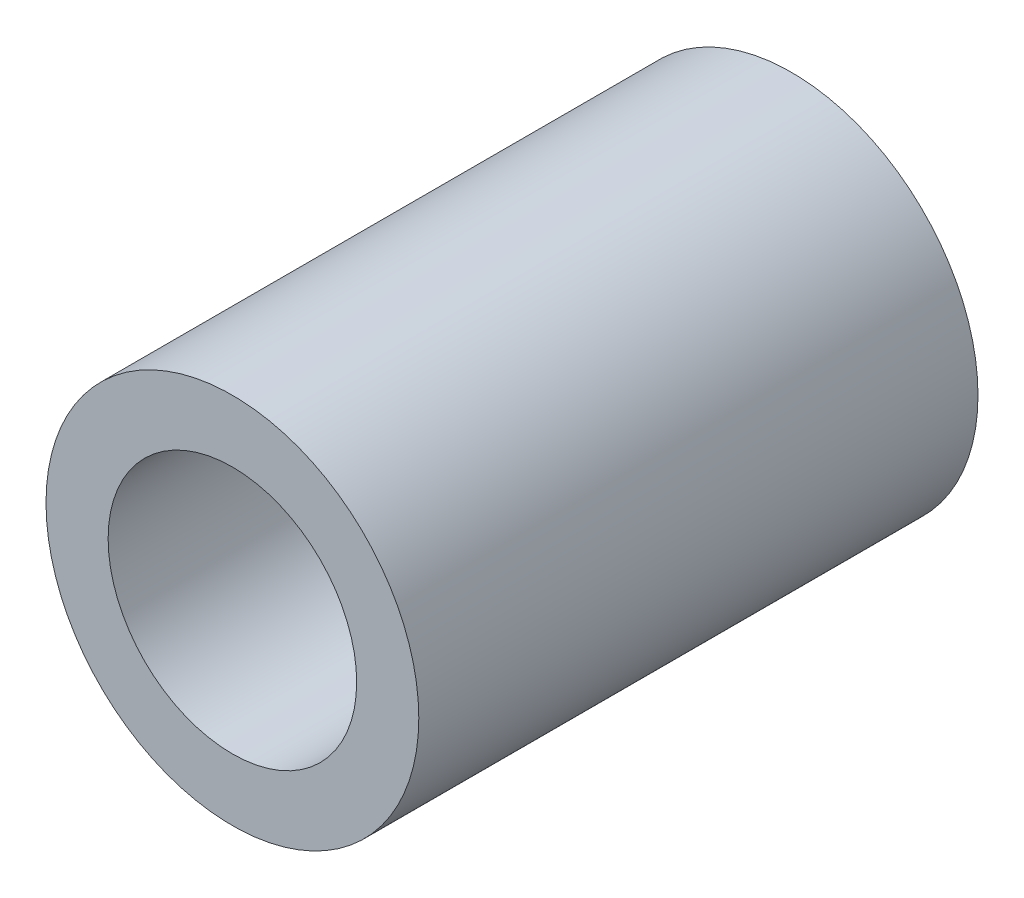
ISO-10303-21;
HEADER;
FILE_DESCRIPTION(('STEP AP214'),'2;1');
FILE_NAME('part.step','',(''),(''),'','','');
FILE_SCHEMA(('AUTOMOTIVE_DESIGN { 1 0 10303 214 1 1 1 1 }'));
ENDSEC;
DATA;
#1=APPLICATION_CONTEXT('core data for automotive mechanical design processes');
#2=APPLICATION_PROTOCOL_DEFINITION('international standard','automotive_design',2000,#1);
#3=PRODUCT_CONTEXT('',#1,'mechanical');
#4=PRODUCT('Part','Part','',(#3));
#5=PRODUCT_RELATED_PRODUCT_CATEGORY('part','',(#4));
#6=PRODUCT_DEFINITION_FORMATION('','',#4);
#7=PRODUCT_DEFINITION_CONTEXT('part definition',#1,'design');
#8=PRODUCT_DEFINITION('design','',#6,#7);
#9=PRODUCT_DEFINITION_SHAPE('','',#8);
#10=(LENGTH_UNIT() NAMED_UNIT(*) SI_UNIT(.MILLI.,.METRE.));
#11=(NAMED_UNIT(*) PLANE_ANGLE_UNIT() SI_UNIT($,.RADIAN.));
#12=(NAMED_UNIT(*) SI_UNIT($,.STERADIAN.) SOLID_ANGLE_UNIT());
#13=UNCERTAINTY_MEASURE_WITH_UNIT(LENGTH_MEASURE(1.E-05),#10,'distance_accuracy_value','');
#14=(GEOMETRIC_REPRESENTATION_CONTEXT(3) GLOBAL_UNCERTAINTY_ASSIGNED_CONTEXT((#13)) GLOBAL_UNIT_ASSIGNED_CONTEXT((#10,
#11,#12)) REPRESENTATION_CONTEXT('',''));
#15=CARTESIAN_POINT('',(0.,0.,0.));
#16=DIRECTION('',(0.,0.,1.));
#17=DIRECTION('',(1.,0.,0.));
#18=AXIS2_PLACEMENT_3D('',#15,#16,#17);
#19=CARTESIAN_POINT('',(0.,0.,9.));
#20=DIRECTION('',(0.,0.,1.));
#21=DIRECTION('',(1.,0.,0.));
#22=AXIS2_PLACEMENT_3D('',#19,#20,#21);
#23=PLANE('',#22);
#24=CARTESIAN_POINT('',(0.,0.,9.));
#25=DIRECTION('',(0.,0.,1.));
#26=DIRECTION('',(1.,0.,0.));
#27=AXIS2_PLACEMENT_3D('',#24,#25,#26);
#28=CIRCLE('',#27,3.);
#29=CARTESIAN_POINT('',(3.,0.,9.));
#30=VERTEX_POINT('',#29);
#31=EDGE_CURVE('E10',#30,#30,#28,.T.);
#32=ORIENTED_EDGE('',*,*,#31,.T.);
#33=EDGE_LOOP('',(#32));
#34=FACE_BOUND('',#33,.T.);
#35=CARTESIAN_POINT('',(0.,0.,9.));
#36=DIRECTION('',(0.,0.,1.));
#37=DIRECTION('',(1.,0.,0.));
#38=AXIS2_PLACEMENT_3D('',#35,#36,#37);
#39=CIRCLE('',#38,2.);
#40=CARTESIAN_POINT('',(2.,0.,9.));
#41=VERTEX_POINT('',#40);
#42=EDGE_CURVE('E46',#41,#41,#39,.T.);
#43=ORIENTED_EDGE('',*,*,#42,.F.);
#44=EDGE_LOOP('',(#43));
#45=FACE_BOUND('',#44,.T.);
#46=ADVANCED_FACE('F35',(#34,#45),#23,.T.);
#47=CARTESIAN_POINT('',(0.,0.,0.));
#48=DIRECTION('',(0.,0.,1.));
#49=DIRECTION('',(1.,0.,0.));
#50=AXIS2_PLACEMENT_3D('',#47,#48,#49);
#51=PLANE('',#50);
#52=CARTESIAN_POINT('',(0.,0.,0.));
#53=DIRECTION('',(0.,0.,1.));
#54=DIRECTION('',(1.,0.,0.));
#55=AXIS2_PLACEMENT_3D('',#52,#53,#54);
#56=CIRCLE('',#55,3.);
#57=CARTESIAN_POINT('',(3.,0.,0.));
#58=VERTEX_POINT('',#57);
#59=EDGE_CURVE('E39',#58,#58,#56,.T.);
#60=ORIENTED_EDGE('',*,*,#59,.F.);
#61=EDGE_LOOP('',(#60));
#62=FACE_BOUND('',#61,.T.);
#63=CARTESIAN_POINT('',(0.,0.,0.));
#64=DIRECTION('',(0.,0.,1.));
#65=DIRECTION('',(1.,0.,0.));
#66=AXIS2_PLACEMENT_3D('',#63,#64,#65);
#67=CIRCLE('',#66,2.);
#68=CARTESIAN_POINT('',(2.,0.,0.));
#69=VERTEX_POINT('',#68);
#70=EDGE_CURVE('E48',#69,#69,#67,.T.);
#71=ORIENTED_EDGE('',*,*,#70,.T.);
#72=EDGE_LOOP('',(#71));
#73=FACE_BOUND('',#72,.T.);
#74=ADVANCED_FACE('F58',(#62,#73),#51,.F.);
#75=CARTESIAN_POINT('',(0.,0.,9.));
#76=DIRECTION('',(0.,0.,-1.));
#77=DIRECTION('',(-1.,0.,0.));
#78=AXIS2_PLACEMENT_3D('',#75,#76,#77);
#79=CYLINDRICAL_SURFACE('',#78,3.);
#80=ORIENTED_EDGE('',*,*,#31,.F.);
#81=EDGE_LOOP('',(#80));
#82=FACE_BOUND('',#81,.T.);
#83=ORIENTED_EDGE('',*,*,#59,.T.);
#84=EDGE_LOOP('',(#83));
#85=FACE_BOUND('',#84,.T.);
#86=ADVANCED_FACE('F37',(#82,#85),#79,.T.);
#87=CARTESIAN_POINT('',(0.,0.,9.));
#88=DIRECTION('',(0.,0.,-1.));
#89=DIRECTION('',(-1.,0.,0.));
#90=AXIS2_PLACEMENT_3D('',#87,#88,#89);
#91=CYLINDRICAL_SURFACE('',#90,2.);
#92=ORIENTED_EDGE('',*,*,#42,.T.);
#93=EDGE_LOOP('',(#92));
#94=FACE_BOUND('',#93,.T.);
#95=ORIENTED_EDGE('',*,*,#70,.F.);
#96=EDGE_LOOP('',(#95));
#97=FACE_BOUND('',#96,.T.);
#98=ADVANCED_FACE('F54',(#94,#97),#91,.F.);
#99=CLOSED_SHELL('',(#46,#74,#86,#98));
#100=MANIFOLD_SOLID_BREP('B2',#99);
#101=ADVANCED_BREP_SHAPE_REPRESENTATION('',(#18,#100),#14);
#102=SHAPE_DEFINITION_REPRESENTATION(#9,#101);
ENDSEC;
END-ISO-10303-21;
